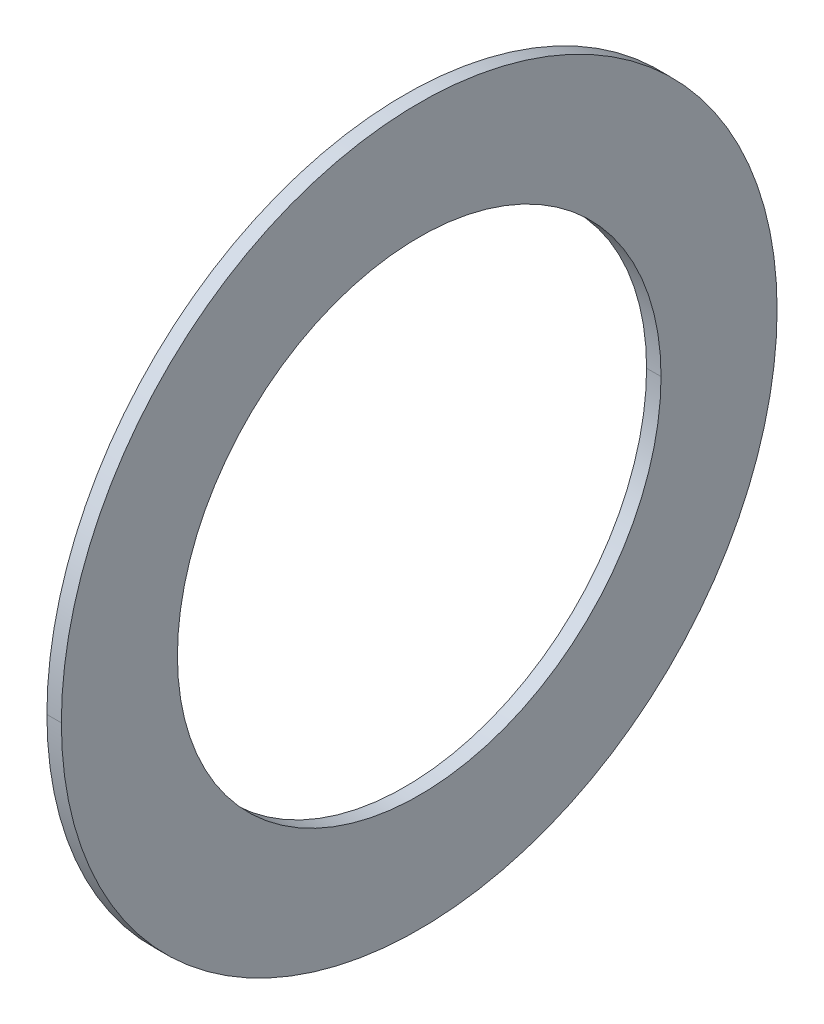
ISO-10303-21;
HEADER;
FILE_DESCRIPTION(('STEP AP214'),'2;1');
FILE_NAME('part.step','',(''),(''),'','','');
FILE_SCHEMA(('AUTOMOTIVE_DESIGN { 1 0 10303 214 1 1 1 1 }'));
ENDSEC;
DATA;
#1=APPLICATION_CONTEXT('core data for automotive mechanical design processes');
#2=APPLICATION_PROTOCOL_DEFINITION('international standard','automotive_design',2000,#1);
#3=PRODUCT_CONTEXT('',#1,'mechanical');
#4=PRODUCT('Part','Part','',(#3));
#5=PRODUCT_RELATED_PRODUCT_CATEGORY('part','',(#4));
#6=PRODUCT_DEFINITION_FORMATION('','',#4);
#7=PRODUCT_DEFINITION_CONTEXT('part definition',#1,'design');
#8=PRODUCT_DEFINITION('design','',#6,#7);
#9=PRODUCT_DEFINITION_SHAPE('','',#8);
#10=(LENGTH_UNIT() NAMED_UNIT(*) SI_UNIT(.MILLI.,.METRE.));
#11=(NAMED_UNIT(*) PLANE_ANGLE_UNIT() SI_UNIT($,.RADIAN.));
#12=(NAMED_UNIT(*) SI_UNIT($,.STERADIAN.) SOLID_ANGLE_UNIT());
#13=UNCERTAINTY_MEASURE_WITH_UNIT(LENGTH_MEASURE(1.E-05),#10,'distance_accuracy_value','');
#14=(GEOMETRIC_REPRESENTATION_CONTEXT(3) GLOBAL_UNCERTAINTY_ASSIGNED_CONTEXT((#13)) GLOBAL_UNIT_ASSIGNED_CONTEXT((#10,
#11,#12)) REPRESENTATION_CONTEXT('',''));
#15=CARTESIAN_POINT('',(0.,0.,0.));
#16=DIRECTION('',(0.,0.,1.));
#17=DIRECTION('',(1.,0.,0.));
#18=AXIS2_PLACEMENT_3D('',#15,#16,#17);
#19=CARTESIAN_POINT('',(2.8008,3.7,0.));
#20=DIRECTION('',(-1.,0.,0.));
#21=DIRECTION('',(0.,0.,1.));
#22=AXIS2_PLACEMENT_3D('',#19,#20,#21);
#23=PLANE('',#22);
#24=CARTESIAN_POINT('',(2.8008,0.,0.));
#25=DIRECTION('',(1.,0.,0.));
#26=DIRECTION('',(0.,0.,-1.));
#27=AXIS2_PLACEMENT_3D('',#24,#25,#26);
#28=CIRCLE('',#27,2.5);
#29=CARTESIAN_POINT('',(2.8008,0.,-2.5));
#30=VERTEX_POINT('',#29);
#31=CARTESIAN_POINT('',(2.8008,0.,2.5));
#32=VERTEX_POINT('',#31);
#33=EDGE_CURVE('E11',#30,#32,#28,.T.);
#34=ORIENTED_EDGE('',*,*,#33,.T.);
#35=CARTESIAN_POINT('',(2.8008,0.,0.));
#36=DIRECTION('',(1.,0.,0.));
#37=DIRECTION('',(0.,0.,-1.));
#38=AXIS2_PLACEMENT_3D('',#35,#36,#37);
#39=CIRCLE('',#38,2.5);
#40=EDGE_CURVE('E25',#32,#30,#39,.T.);
#41=ORIENTED_EDGE('',*,*,#40,.T.);
#42=EDGE_LOOP('',(#34,#41));
#43=FACE_BOUND('',#42,.T.);
#44=CARTESIAN_POINT('',(2.8008,0.,0.));
#45=DIRECTION('',(1.,0.,0.));
#46=DIRECTION('',(0.,0.,-1.));
#47=AXIS2_PLACEMENT_3D('',#44,#45,#46);
#48=CIRCLE('',#47,3.7);
#49=CARTESIAN_POINT('',(2.8008,0.,3.7));
#50=VERTEX_POINT('',#49);
#51=CARTESIAN_POINT('',(2.8008,0.,-3.7));
#52=VERTEX_POINT('',#51);
#53=EDGE_CURVE('E95',#50,#52,#48,.T.);
#54=ORIENTED_EDGE('',*,*,#53,.F.);
#55=CARTESIAN_POINT('',(2.8008,0.,0.));
#56=DIRECTION('',(1.,0.,0.));
#57=DIRECTION('',(0.,0.,-1.));
#58=AXIS2_PLACEMENT_3D('',#55,#56,#57);
#59=CIRCLE('',#58,3.7);
#60=EDGE_CURVE('E90',#52,#50,#59,.T.);
#61=ORIENTED_EDGE('',*,*,#60,.F.);
#62=EDGE_LOOP('',(#54,#61));
#63=FACE_BOUND('',#62,.T.);
#64=ADVANCED_FACE('F17',(#43,#63),#23,.T.);
#65=CARTESIAN_POINT('',(2.9502,0.,0.));
#66=DIRECTION('',(1.,0.,0.));
#67=DIRECTION('',(0.,-1.,0.));
#68=AXIS2_PLACEMENT_3D('',#65,#66,#67);
#69=CYLINDRICAL_SURFACE('',#68,3.7);
#70=DIRECTION('',(1.,0.,0.));
#71=VECTOR('',#70,1.);
#72=CARTESIAN_POINT('',(2.8008,0.,3.7));
#73=LINE('',#72,#71);
#74=CARTESIAN_POINT('',(2.9502,0.,3.7));
#75=VERTEX_POINT('',#74);
#76=EDGE_CURVE('E86',#50,#75,#73,.T.);
#77=ORIENTED_EDGE('',*,*,#76,.T.);
#78=CARTESIAN_POINT('',(2.9502,0.,0.));
#79=DIRECTION('',(1.,0.,0.));
#80=DIRECTION('',(0.,0.,-1.));
#81=AXIS2_PLACEMENT_3D('',#78,#79,#80);
#82=CIRCLE('',#81,3.7);
#83=CARTESIAN_POINT('',(2.9502,0.,-3.7));
#84=VERTEX_POINT('',#83);
#85=EDGE_CURVE('E81',#84,#75,#82,.T.);
#86=ORIENTED_EDGE('',*,*,#85,.F.);
#87=DIRECTION('',(1.,0.,0.));
#88=VECTOR('',#87,1.);
#89=CARTESIAN_POINT('',(2.8008,0.,-3.7));
#90=LINE('',#89,#88);
#91=EDGE_CURVE('E70',#52,#84,#90,.T.);
#92=ORIENTED_EDGE('',*,*,#91,.F.);
#93=ORIENTED_EDGE('',*,*,#60,.T.);
#94=EDGE_LOOP('',(#77,#86,#92,#93));
#95=FACE_BOUND('',#94,.T.);
#96=ADVANCED_FACE('F111',(#95),#69,.T.);
#97=CARTESIAN_POINT('',(2.9502,0.,0.));
#98=DIRECTION('',(1.,0.,0.));
#99=DIRECTION('',(0.,1.,0.));
#100=AXIS2_PLACEMENT_3D('',#97,#98,#99);
#101=CYLINDRICAL_SURFACE('',#100,3.7);
#102=ORIENTED_EDGE('',*,*,#76,.F.);
#103=ORIENTED_EDGE('',*,*,#53,.T.);
#104=ORIENTED_EDGE('',*,*,#91,.T.);
#105=CARTESIAN_POINT('',(2.9502,0.,0.));
#106=DIRECTION('',(1.,0.,0.));
#107=DIRECTION('',(0.,0.,-1.));
#108=AXIS2_PLACEMENT_3D('',#105,#106,#107);
#109=CIRCLE('',#108,3.7);
#110=EDGE_CURVE('E67',#75,#84,#109,.T.);
#111=ORIENTED_EDGE('',*,*,#110,.F.);
#112=EDGE_LOOP('',(#102,#103,#104,#111));
#113=FACE_BOUND('',#112,.T.);
#114=ADVANCED_FACE('F106',(#113),#101,.T.);
#115=CARTESIAN_POINT('',(2.9502,2.5,0.));
#116=DIRECTION('',(1.,0.,0.));
#117=DIRECTION('',(0.,0.,-1.));
#118=AXIS2_PLACEMENT_3D('',#115,#116,#117);
#119=PLANE('',#118);
#120=ORIENTED_EDGE('',*,*,#85,.T.);
#121=ORIENTED_EDGE('',*,*,#110,.T.);
#122=EDGE_LOOP('',(#120,#121));
#123=FACE_BOUND('',#122,.T.);
#124=CARTESIAN_POINT('',(2.9502,0.,0.));
#125=DIRECTION('',(1.,0.,0.));
#126=DIRECTION('',(0.,0.,-1.));
#127=AXIS2_PLACEMENT_3D('',#124,#125,#126);
#128=CIRCLE('',#127,2.5);
#129=CARTESIAN_POINT('',(2.9502,0.,2.5));
#130=VERTEX_POINT('',#129);
#131=CARTESIAN_POINT('',(2.9502,0.,-2.5));
#132=VERTEX_POINT('',#131);
#133=EDGE_CURVE('E55',#130,#132,#128,.T.);
#134=ORIENTED_EDGE('',*,*,#133,.F.);
#135=CARTESIAN_POINT('',(2.9502,0.,0.));
#136=DIRECTION('',(1.,0.,0.));
#137=DIRECTION('',(0.,0.,-1.));
#138=AXIS2_PLACEMENT_3D('',#135,#136,#137);
#139=CIRCLE('',#138,2.5);
#140=EDGE_CURVE('E51',#132,#130,#139,.T.);
#141=ORIENTED_EDGE('',*,*,#140,.F.);
#142=EDGE_LOOP('',(#134,#141));
#143=FACE_BOUND('',#142,.T.);
#144=ADVANCED_FACE('F53',(#123,#143),#119,.T.);
#145=CARTESIAN_POINT('',(2.9502,0.,0.));
#146=DIRECTION('',(1.,0.,0.));
#147=DIRECTION('',(0.,-1.,0.));
#148=AXIS2_PLACEMENT_3D('',#145,#146,#147);
#149=CYLINDRICAL_SURFACE('',#148,2.5);
#150=DIRECTION('',(1.,0.,0.));
#151=VECTOR('',#150,1.);
#152=CARTESIAN_POINT('',(2.8008,0.,2.5));
#153=LINE('',#152,#151);
#154=EDGE_CURVE('E59',#32,#130,#153,.T.);
#155=ORIENTED_EDGE('',*,*,#154,.F.);
#156=ORIENTED_EDGE('',*,*,#33,.F.);
#157=DIRECTION('',(1.,0.,0.));
#158=VECTOR('',#157,1.);
#159=CARTESIAN_POINT('',(2.8008,0.,-2.5));
#160=LINE('',#159,#158);
#161=EDGE_CURVE('E62',#30,#132,#160,.T.);
#162=ORIENTED_EDGE('',*,*,#161,.T.);
#163=ORIENTED_EDGE('',*,*,#140,.T.);
#164=EDGE_LOOP('',(#155,#156,#162,#163));
#165=FACE_BOUND('',#164,.T.);
#166=ADVANCED_FACE('F63',(#165),#149,.F.);
#167=CARTESIAN_POINT('',(2.9502,0.,0.));
#168=DIRECTION('',(1.,0.,0.));
#169=DIRECTION('',(0.,1.,0.));
#170=AXIS2_PLACEMENT_3D('',#167,#168,#169);
#171=CYLINDRICAL_SURFACE('',#170,2.5);
#172=ORIENTED_EDGE('',*,*,#154,.T.);
#173=ORIENTED_EDGE('',*,*,#133,.T.);
#174=ORIENTED_EDGE('',*,*,#161,.F.);
#175=ORIENTED_EDGE('',*,*,#40,.F.);
#176=EDGE_LOOP('',(#172,#173,#174,#175));
#177=FACE_BOUND('',#176,.T.);
#178=ADVANCED_FACE('F66',(#177),#171,.F.);
#179=CLOSED_SHELL('',(#64,#96,#114,#144,#166,#178));
#180=MANIFOLD_SOLID_BREP('B1',#179);
#181=ADVANCED_BREP_SHAPE_REPRESENTATION('',(#18,#180),#14);
#182=SHAPE_DEFINITION_REPRESENTATION(#9,#181);
ENDSEC;
END-ISO-10303-21;
